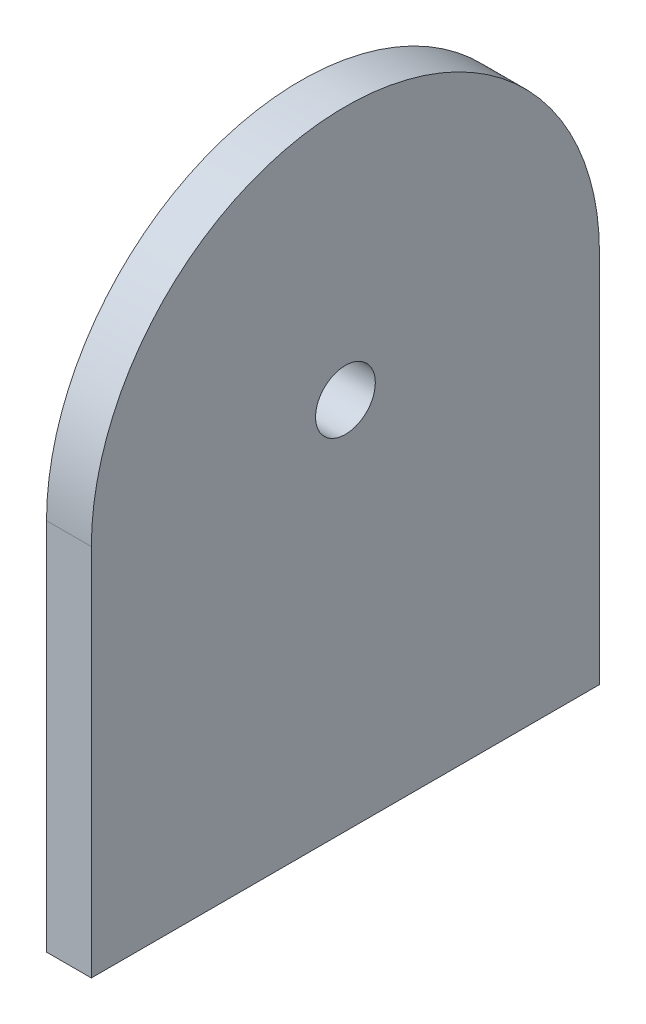
ISO-10303-21;
HEADER;
FILE_DESCRIPTION(('STEP AP214'),'2;1');
FILE_NAME('part.step','',(''),(''),'','','');
FILE_SCHEMA(('AUTOMOTIVE_DESIGN { 1 0 10303 214 1 1 1 1 }'));
ENDSEC;
DATA;
#1=APPLICATION_CONTEXT('core data for automotive mechanical design processes');
#2=APPLICATION_PROTOCOL_DEFINITION('international standard','automotive_design',2000,#1);
#3=PRODUCT_CONTEXT('',#1,'mechanical');
#4=PRODUCT('Part','Part','',(#3));
#5=PRODUCT_RELATED_PRODUCT_CATEGORY('part','',(#4));
#6=PRODUCT_DEFINITION_FORMATION('','',#4);
#7=PRODUCT_DEFINITION_CONTEXT('part definition',#1,'design');
#8=PRODUCT_DEFINITION('design','',#6,#7);
#9=PRODUCT_DEFINITION_SHAPE('','',#8);
#10=(LENGTH_UNIT() NAMED_UNIT(*) SI_UNIT(.MILLI.,.METRE.));
#11=(NAMED_UNIT(*) PLANE_ANGLE_UNIT() SI_UNIT($,.RADIAN.));
#12=(NAMED_UNIT(*) SI_UNIT($,.STERADIAN.) SOLID_ANGLE_UNIT());
#13=UNCERTAINTY_MEASURE_WITH_UNIT(LENGTH_MEASURE(1.E-05),#10,'distance_accuracy_value','');
#14=(GEOMETRIC_REPRESENTATION_CONTEXT(3) GLOBAL_UNCERTAINTY_ASSIGNED_CONTEXT((#13)) GLOBAL_UNIT_ASSIGNED_CONTEXT((#10,
#11,#12)) REPRESENTATION_CONTEXT('',''));
#15=CARTESIAN_POINT('',(0.,0.,0.));
#16=DIRECTION('',(0.,0.,1.));
#17=DIRECTION('',(1.,0.,0.));
#18=AXIS2_PLACEMENT_3D('',#15,#16,#17);
#19=CARTESIAN_POINT('',(3.,25.,-17.));
#20=DIRECTION('',(1.,0.,0.));
#21=DIRECTION('',(0.,0.,-1.));
#22=AXIS2_PLACEMENT_3D('',#19,#20,#21);
#23=PLANE('',#22);
#24=DIRECTION('',(0.,1.,0.));
#25=VECTOR('',#24,1.);
#26=CARTESIAN_POINT('',(3.,25.,-34.));
#27=LINE('',#26,#25);
#28=CARTESIAN_POINT('',(3.,0.,-34.));
#29=VERTEX_POINT('',#28);
#30=CARTESIAN_POINT('',(3.,25.,-34.));
#31=VERTEX_POINT('',#30);
#32=EDGE_CURVE('E85',#29,#31,#27,.T.);
#33=ORIENTED_EDGE('',*,*,#32,.T.);
#34=CARTESIAN_POINT('',(3.,25.,-17.));
#35=DIRECTION('',(1.,0.,0.));
#36=DIRECTION('',(0.,0.,-1.));
#37=AXIS2_PLACEMENT_3D('',#34,#35,#36);
#38=CIRCLE('',#37,17.);
#39=CARTESIAN_POINT('',(3.,25.,0.));
#40=VERTEX_POINT('',#39);
#41=EDGE_CURVE('E80',#31,#40,#38,.T.);
#42=ORIENTED_EDGE('',*,*,#41,.T.);
#43=DIRECTION('',(0.,-1.,0.));
#44=VECTOR('',#43,1.);
#45=CARTESIAN_POINT('',(3.,0.,0.));
#46=LINE('',#45,#44);
#47=CARTESIAN_POINT('',(3.,0.,0.));
#48=VERTEX_POINT('',#47);
#49=EDGE_CURVE('E83',#40,#48,#46,.T.);
#50=ORIENTED_EDGE('',*,*,#49,.T.);
#51=DIRECTION('',(0.,0.,-1.));
#52=VECTOR('',#51,1.);
#53=CARTESIAN_POINT('',(3.,0.,0.));
#54=LINE('',#53,#52);
#55=EDGE_CURVE('E50',#48,#29,#54,.T.);
#56=ORIENTED_EDGE('',*,*,#55,.T.);
#57=EDGE_LOOP('',(#33,#42,#50,#56));
#58=FACE_BOUND('',#57,.T.);
#59=CARTESIAN_POINT('',(3.,25.,-17.));
#60=DIRECTION('',(1.,0.,0.));
#61=DIRECTION('',(0.,0.,-1.));
#62=AXIS2_PLACEMENT_3D('',#59,#60,#61);
#63=CIRCLE('',#62,2.);
#64=CARTESIAN_POINT('',(3.,25.,-19.));
#65=VERTEX_POINT('',#64);
#66=EDGE_CURVE('E100',#65,#65,#63,.T.);
#67=ORIENTED_EDGE('',*,*,#66,.F.);
#68=EDGE_LOOP('',(#67));
#69=FACE_BOUND('',#68,.T.);
#70=ADVANCED_FACE('F33',(#58,#69),#23,.T.);
#71=CARTESIAN_POINT('',(0.,25.,-17.));
#72=DIRECTION('',(1.,0.,0.));
#73=DIRECTION('',(0.,0.,-1.));
#74=AXIS2_PLACEMENT_3D('',#71,#72,#73);
#75=PLANE('',#74);
#76=DIRECTION('',(0.,1.,0.));
#77=VECTOR('',#76,1.);
#78=CARTESIAN_POINT('',(0.,25.,-34.));
#79=LINE('',#78,#77);
#80=CARTESIAN_POINT('',(0.,0.,-34.));
#81=VERTEX_POINT('',#80);
#82=CARTESIAN_POINT('',(0.,25.,-34.));
#83=VERTEX_POINT('',#82);
#84=EDGE_CURVE('E97',#81,#83,#79,.T.);
#85=ORIENTED_EDGE('',*,*,#84,.F.);
#86=DIRECTION('',(0.,0.,-1.));
#87=VECTOR('',#86,1.);
#88=CARTESIAN_POINT('',(0.,0.,0.));
#89=LINE('',#88,#87);
#90=CARTESIAN_POINT('',(0.,0.,0.));
#91=VERTEX_POINT('',#90);
#92=EDGE_CURVE('E73',#91,#81,#89,.T.);
#93=ORIENTED_EDGE('',*,*,#92,.F.);
#94=DIRECTION('',(0.,-1.,0.));
#95=VECTOR('',#94,1.);
#96=CARTESIAN_POINT('',(0.,0.,0.));
#97=LINE('',#96,#95);
#98=CARTESIAN_POINT('',(0.,25.,0.));
#99=VERTEX_POINT('',#98);
#100=EDGE_CURVE('E67',#99,#91,#97,.T.);
#101=ORIENTED_EDGE('',*,*,#100,.F.);
#102=CARTESIAN_POINT('',(0.,25.,-17.));
#103=DIRECTION('',(1.,0.,0.));
#104=DIRECTION('',(0.,0.,-1.));
#105=AXIS2_PLACEMENT_3D('',#102,#103,#104);
#106=CIRCLE('',#105,17.);
#107=EDGE_CURVE('E89',#83,#99,#106,.T.);
#108=ORIENTED_EDGE('',*,*,#107,.F.);
#109=EDGE_LOOP('',(#85,#93,#101,#108));
#110=FACE_BOUND('',#109,.T.);
#111=CARTESIAN_POINT('',(0.,25.,-17.));
#112=DIRECTION('',(1.,0.,0.));
#113=DIRECTION('',(0.,0.,-1.));
#114=AXIS2_PLACEMENT_3D('',#111,#112,#113);
#115=CIRCLE('',#114,2.);
#116=CARTESIAN_POINT('',(0.,25.,-19.));
#117=VERTEX_POINT('',#116);
#118=EDGE_CURVE('E112',#117,#117,#115,.T.);
#119=ORIENTED_EDGE('',*,*,#118,.T.);
#120=EDGE_LOOP('',(#119));
#121=FACE_BOUND('',#120,.T.);
#122=ADVANCED_FACE('F108',(#110,#121),#75,.F.);
#123=CARTESIAN_POINT('',(3.,25.,-34.));
#124=DIRECTION('',(0.,0.,1.));
#125=DIRECTION('',(1.,0.,0.));
#126=AXIS2_PLACEMENT_3D('',#123,#124,#125);
#127=PLANE('',#126);
#128=ORIENTED_EDGE('',*,*,#84,.T.);
#129=DIRECTION('',(-1.,0.,0.));
#130=VECTOR('',#129,1.);
#131=CARTESIAN_POINT('',(3.,25.,-34.));
#132=LINE('',#131,#130);
#133=EDGE_CURVE('E11',#31,#83,#132,.T.);
#134=ORIENTED_EDGE('',*,*,#133,.F.);
#135=ORIENTED_EDGE('',*,*,#32,.F.);
#136=DIRECTION('',(-1.,0.,0.));
#137=VECTOR('',#136,1.);
#138=CARTESIAN_POINT('',(3.,0.,-34.));
#139=LINE('',#138,#137);
#140=EDGE_CURVE('E93',#29,#81,#139,.T.);
#141=ORIENTED_EDGE('',*,*,#140,.T.);
#142=EDGE_LOOP('',(#128,#134,#135,#141));
#143=FACE_BOUND('',#142,.T.);
#144=ADVANCED_FACE('F35',(#143),#127,.F.);
#145=CARTESIAN_POINT('',(3.,25.,-17.));
#146=DIRECTION('',(-1.,0.,0.));
#147=DIRECTION('',(0.,0.,1.));
#148=AXIS2_PLACEMENT_3D('',#145,#146,#147);
#149=CYLINDRICAL_SURFACE('',#148,17.);
#150=ORIENTED_EDGE('',*,*,#107,.T.);
#151=DIRECTION('',(-1.,0.,0.));
#152=VECTOR('',#151,1.);
#153=CARTESIAN_POINT('',(3.,25.,0.));
#154=LINE('',#153,#152);
#155=EDGE_CURVE('E42',#40,#99,#154,.T.);
#156=ORIENTED_EDGE('',*,*,#155,.F.);
#157=ORIENTED_EDGE('',*,*,#41,.F.);
#158=ORIENTED_EDGE('',*,*,#133,.T.);
#159=EDGE_LOOP('',(#150,#156,#157,#158));
#160=FACE_BOUND('',#159,.T.);
#161=ADVANCED_FACE('F88',(#160),#149,.T.);
#162=CARTESIAN_POINT('',(3.,0.,0.));
#163=DIRECTION('',(0.,0.,-1.));
#164=DIRECTION('',(0.,1.,0.));
#165=AXIS2_PLACEMENT_3D('',#162,#163,#164);
#166=PLANE('',#165);
#167=ORIENTED_EDGE('',*,*,#100,.T.);
#168=DIRECTION('',(-1.,0.,0.));
#169=VECTOR('',#168,1.);
#170=CARTESIAN_POINT('',(3.,0.,0.));
#171=LINE('',#170,#169);
#172=EDGE_CURVE('E90',#48,#91,#171,.T.);
#173=ORIENTED_EDGE('',*,*,#172,.F.);
#174=ORIENTED_EDGE('',*,*,#49,.F.);
#175=ORIENTED_EDGE('',*,*,#155,.T.);
#176=EDGE_LOOP('',(#167,#173,#174,#175));
#177=FACE_BOUND('',#176,.T.);
#178=ADVANCED_FACE('F91',(#177),#166,.F.);
#179=CARTESIAN_POINT('',(3.,0.,0.));
#180=DIRECTION('',(0.,1.,0.));
#181=DIRECTION('',(0.,0.,1.));
#182=AXIS2_PLACEMENT_3D('',#179,#180,#181);
#183=PLANE('',#182);
#184=ORIENTED_EDGE('',*,*,#92,.T.);
#185=ORIENTED_EDGE('',*,*,#140,.F.);
#186=ORIENTED_EDGE('',*,*,#55,.F.);
#187=ORIENTED_EDGE('',*,*,#172,.T.);
#188=EDGE_LOOP('',(#184,#185,#186,#187));
#189=FACE_BOUND('',#188,.T.);
#190=ADVANCED_FACE('F105',(#189),#183,.F.);
#191=CARTESIAN_POINT('',(3.,25.,-17.));
#192=DIRECTION('',(-1.,0.,0.));
#193=DIRECTION('',(0.,0.,1.));
#194=AXIS2_PLACEMENT_3D('',#191,#192,#193);
#195=CYLINDRICAL_SURFACE('',#194,2.);
#196=ORIENTED_EDGE('',*,*,#66,.T.);
#197=EDGE_LOOP('',(#196));
#198=FACE_BOUND('',#197,.T.);
#199=ORIENTED_EDGE('',*,*,#118,.F.);
#200=EDGE_LOOP('',(#199));
#201=FACE_BOUND('',#200,.T.);
#202=ADVANCED_FACE('F118',(#198,#201),#195,.F.);
#203=CLOSED_SHELL('',(#70,#122,#144,#161,#178,#190,#202));
#204=MANIFOLD_SOLID_BREP('B2',#203);
#205=ADVANCED_BREP_SHAPE_REPRESENTATION('',(#18,#204),#14);
#206=SHAPE_DEFINITION_REPRESENTATION(#9,#205);
ENDSEC;
END-ISO-10303-21;
